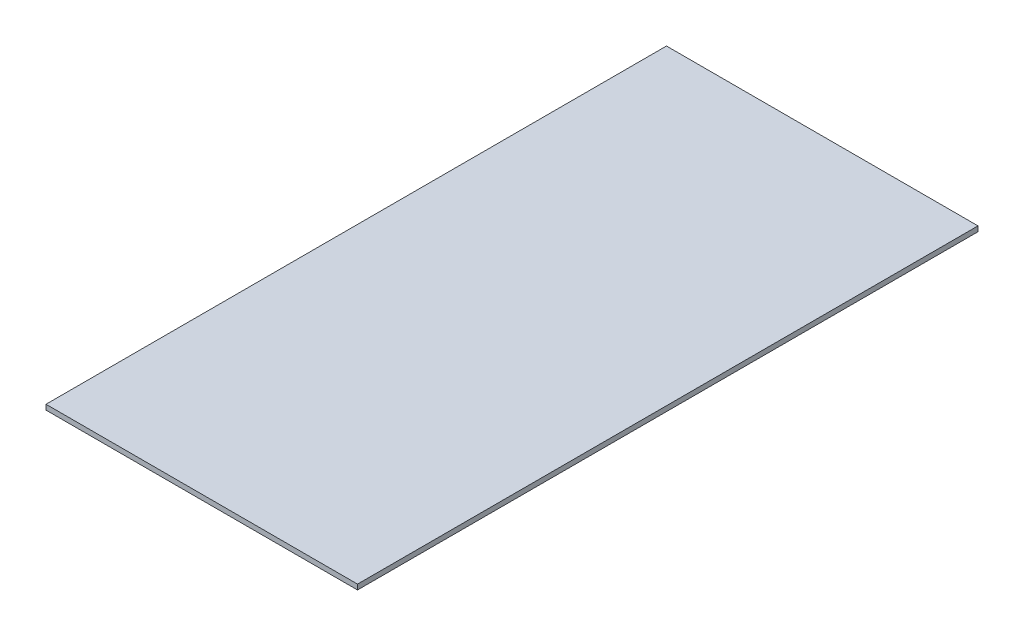
ISO-10303-21;
HEADER;
FILE_DESCRIPTION(('STEP AP214'),'2;1');
FILE_NAME('part.step','',(''),(''),'','','');
FILE_SCHEMA(('AUTOMOTIVE_DESIGN { 1 0 10303 214 1 1 1 1 }'));
ENDSEC;
DATA;
#1=APPLICATION_CONTEXT('core data for automotive mechanical design processes');
#2=APPLICATION_PROTOCOL_DEFINITION('international standard','automotive_design',2000,#1);
#3=PRODUCT_CONTEXT('',#1,'mechanical');
#4=PRODUCT('Part','Part','',(#3));
#5=PRODUCT_RELATED_PRODUCT_CATEGORY('part','',(#4));
#6=PRODUCT_DEFINITION_FORMATION('','',#4);
#7=PRODUCT_DEFINITION_CONTEXT('part definition',#1,'design');
#8=PRODUCT_DEFINITION('design','',#6,#7);
#9=PRODUCT_DEFINITION_SHAPE('','',#8);
#10=(LENGTH_UNIT() NAMED_UNIT(*) SI_UNIT(.MILLI.,.METRE.));
#11=(NAMED_UNIT(*) PLANE_ANGLE_UNIT() SI_UNIT($,.RADIAN.));
#12=(NAMED_UNIT(*) SI_UNIT($,.STERADIAN.) SOLID_ANGLE_UNIT());
#13=UNCERTAINTY_MEASURE_WITH_UNIT(LENGTH_MEASURE(1.E-05),#10,'distance_accuracy_value','');
#14=(GEOMETRIC_REPRESENTATION_CONTEXT(3) GLOBAL_UNCERTAINTY_ASSIGNED_CONTEXT((#13)) GLOBAL_UNIT_ASSIGNED_CONTEXT((#10,
#11,#12)) REPRESENTATION_CONTEXT('',''));
#15=CARTESIAN_POINT('',(0.,0.,0.));
#16=DIRECTION('',(0.,0.,1.));
#17=DIRECTION('',(1.,0.,0.));
#18=AXIS2_PLACEMENT_3D('',#15,#16,#17);
#19=CARTESIAN_POINT('',(0.,-20.,0.));
#20=DIRECTION('',(-1.,0.,0.));
#21=DIRECTION('',(0.,0.,1.));
#22=AXIS2_PLACEMENT_3D('',#19,#20,#21);
#23=PLANE('',#22);
#24=DIRECTION('',(0.,0.,1.));
#25=VECTOR('',#24,1.);
#26=CARTESIAN_POINT('',(0.,0.,0.));
#27=LINE('',#26,#25);
#28=CARTESIAN_POINT('',(0.,0.,0.));
#29=VERTEX_POINT('',#28);
#30=CARTESIAN_POINT('',(4.44089209850063E-13,0.,2430.));
#31=VERTEX_POINT('',#30);
#32=EDGE_CURVE('E97',#29,#31,#27,.T.);
#33=ORIENTED_EDGE('',*,*,#32,.F.);
#34=DIRECTION('',(0.,1.,0.));
#35=VECTOR('',#34,1.);
#36=CARTESIAN_POINT('',(0.,-20.,0.));
#37=LINE('',#36,#35);
#38=CARTESIAN_POINT('',(0.,-20.,0.));
#39=VERTEX_POINT('',#38);
#40=EDGE_CURVE('E11',#39,#29,#37,.T.);
#41=ORIENTED_EDGE('',*,*,#40,.F.);
#42=DIRECTION('',(0.,0.,1.));
#43=VECTOR('',#42,1.);
#44=CARTESIAN_POINT('',(0.,-20.,0.));
#45=LINE('',#44,#43);
#46=CARTESIAN_POINT('',(4.44089209850063E-13,-20.,2430.));
#47=VERTEX_POINT('',#46);
#48=EDGE_CURVE('E91',#39,#47,#45,.T.);
#49=ORIENTED_EDGE('',*,*,#48,.T.);
#50=DIRECTION('',(0.,1.,0.));
#51=VECTOR('',#50,1.);
#52=CARTESIAN_POINT('',(4.44089209850063E-13,-20.,2430.));
#53=LINE('',#52,#51);
#54=EDGE_CURVE('E36',#47,#31,#53,.T.);
#55=ORIENTED_EDGE('',*,*,#54,.T.);
#56=EDGE_LOOP('',(#33,#41,#49,#55));
#57=FACE_BOUND('',#56,.T.);
#58=ADVANCED_FACE('F33',(#57),#23,.T.);
#59=CARTESIAN_POINT('',(0.,-20.,0.));
#60=DIRECTION('',(0.,0.,-1.));
#61=DIRECTION('',(-1.,0.,0.));
#62=AXIS2_PLACEMENT_3D('',#59,#60,#61);
#63=PLANE('',#62);
#64=DIRECTION('',(-1.,0.,0.));
#65=VECTOR('',#64,1.);
#66=CARTESIAN_POINT('',(0.,0.,0.));
#67=LINE('',#66,#65);
#68=CARTESIAN_POINT('',(1220.,0.,0.));
#69=VERTEX_POINT('',#68);
#70=EDGE_CURVE('E93',#69,#29,#67,.T.);
#71=ORIENTED_EDGE('',*,*,#70,.F.);
#72=DIRECTION('',(0.,1.,0.));
#73=VECTOR('',#72,1.);
#74=CARTESIAN_POINT('',(1220.,-20.,0.));
#75=LINE('',#74,#73);
#76=CARTESIAN_POINT('',(1220.,-20.,0.));
#77=VERTEX_POINT('',#76);
#78=EDGE_CURVE('E42',#77,#69,#75,.T.);
#79=ORIENTED_EDGE('',*,*,#78,.F.);
#80=DIRECTION('',(-1.,0.,0.));
#81=VECTOR('',#80,1.);
#82=CARTESIAN_POINT('',(0.,-20.,0.));
#83=LINE('',#82,#81);
#84=EDGE_CURVE('E88',#77,#39,#83,.T.);
#85=ORIENTED_EDGE('',*,*,#84,.T.);
#86=ORIENTED_EDGE('',*,*,#40,.T.);
#87=EDGE_LOOP('',(#71,#79,#85,#86));
#88=FACE_BOUND('',#87,.T.);
#89=ADVANCED_FACE('F107',(#88),#63,.T.);
#90=CARTESIAN_POINT('',(1220.,-20.,0.));
#91=DIRECTION('',(1.,0.,0.));
#92=DIRECTION('',(0.,0.,-1.));
#93=AXIS2_PLACEMENT_3D('',#90,#91,#92);
#94=PLANE('',#93);
#95=DIRECTION('',(0.,0.,-1.));
#96=VECTOR('',#95,1.);
#97=CARTESIAN_POINT('',(1220.,0.,0.));
#98=LINE('',#97,#96);
#99=CARTESIAN_POINT('',(1220.,0.,2430.));
#100=VERTEX_POINT('',#99);
#101=EDGE_CURVE('E83',#100,#69,#98,.T.);
#102=ORIENTED_EDGE('',*,*,#101,.F.);
#103=DIRECTION('',(0.,1.,0.));
#104=VECTOR('',#103,1.);
#105=CARTESIAN_POINT('',(1220.,-20.,2430.));
#106=LINE('',#105,#104);
#107=CARTESIAN_POINT('',(1220.,-20.,2430.));
#108=VERTEX_POINT('',#107);
#109=EDGE_CURVE('E78',#108,#100,#106,.T.);
#110=ORIENTED_EDGE('',*,*,#109,.F.);
#111=DIRECTION('',(0.,0.,-1.));
#112=VECTOR('',#111,1.);
#113=CARTESIAN_POINT('',(1220.,-20.,0.));
#114=LINE('',#113,#112);
#115=EDGE_CURVE('E81',#108,#77,#114,.T.);
#116=ORIENTED_EDGE('',*,*,#115,.T.);
#117=ORIENTED_EDGE('',*,*,#78,.T.);
#118=EDGE_LOOP('',(#102,#110,#116,#117));
#119=FACE_BOUND('',#118,.T.);
#120=ADVANCED_FACE('F80',(#119),#94,.T.);
#121=CARTESIAN_POINT('',(4.44089209850063E-13,-20.,2430.));
#122=DIRECTION('',(0.,0.,1.));
#123=DIRECTION('',(1.,0.,0.));
#124=AXIS2_PLACEMENT_3D('',#121,#122,#123);
#125=PLANE('',#124);
#126=DIRECTION('',(1.,0.,0.));
#127=VECTOR('',#126,1.);
#128=CARTESIAN_POINT('',(4.44089209850063E-13,0.,2430.));
#129=LINE('',#128,#127);
#130=EDGE_CURVE('E100',#31,#100,#129,.T.);
#131=ORIENTED_EDGE('',*,*,#130,.F.);
#132=ORIENTED_EDGE('',*,*,#54,.F.);
#133=DIRECTION('',(1.,0.,0.));
#134=VECTOR('',#133,1.);
#135=CARTESIAN_POINT('',(4.44089209850063E-13,-20.,2430.));
#136=LINE('',#135,#134);
#137=EDGE_CURVE('E87',#47,#108,#136,.T.);
#138=ORIENTED_EDGE('',*,*,#137,.T.);
#139=ORIENTED_EDGE('',*,*,#109,.T.);
#140=EDGE_LOOP('',(#131,#132,#138,#139));
#141=FACE_BOUND('',#140,.T.);
#142=ADVANCED_FACE('F90',(#141),#125,.T.);
#143=CARTESIAN_POINT('',(0.,-20.,0.));
#144=DIRECTION('',(0.,1.,0.));
#145=DIRECTION('',(0.,0.,1.));
#146=AXIS2_PLACEMENT_3D('',#143,#144,#145);
#147=PLANE('',#146);
#148=ORIENTED_EDGE('',*,*,#48,.F.);
#149=ORIENTED_EDGE('',*,*,#84,.F.);
#150=ORIENTED_EDGE('',*,*,#115,.F.);
#151=ORIENTED_EDGE('',*,*,#137,.F.);
#152=EDGE_LOOP('',(#148,#149,#150,#151));
#153=FACE_BOUND('',#152,.T.);
#154=ADVANCED_FACE('F86',(#153),#147,.F.);
#155=CARTESIAN_POINT('',(0.,0.,0.));
#156=DIRECTION('',(0.,1.,0.));
#157=DIRECTION('',(0.,0.,1.));
#158=AXIS2_PLACEMENT_3D('',#155,#156,#157);
#159=PLANE('',#158);
#160=ORIENTED_EDGE('',*,*,#32,.T.);
#161=ORIENTED_EDGE('',*,*,#130,.T.);
#162=ORIENTED_EDGE('',*,*,#101,.T.);
#163=ORIENTED_EDGE('',*,*,#70,.T.);
#164=EDGE_LOOP('',(#160,#161,#162,#163));
#165=FACE_BOUND('',#164,.T.);
#166=ADVANCED_FACE('F106',(#165),#159,.T.);
#167=CLOSED_SHELL('',(#58,#89,#120,#142,#154,#166));
#168=MANIFOLD_SOLID_BREP('B2',#167);
#169=ADVANCED_BREP_SHAPE_REPRESENTATION('',(#18,#168),#14);
#170=SHAPE_DEFINITION_REPRESENTATION(#9,#169);
ENDSEC;
END-ISO-10303-21;
